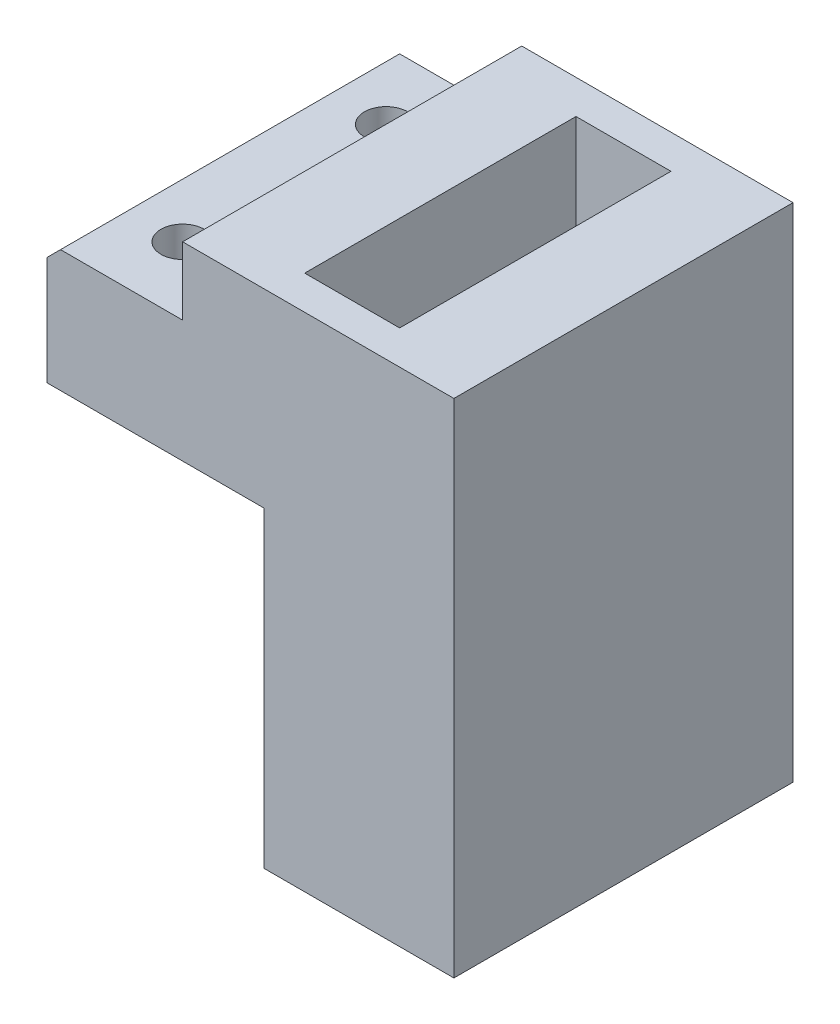
ISO-10303-21;
HEADER;
FILE_DESCRIPTION(('STEP AP214'),'2;1');
FILE_NAME('part.step','',(''),(''),'','','');
FILE_SCHEMA(('AUTOMOTIVE_DESIGN { 1 0 10303 214 1 1 1 1 }'));
ENDSEC;
DATA;
#1=APPLICATION_CONTEXT('core data for automotive mechanical design processes');
#2=APPLICATION_PROTOCOL_DEFINITION('international standard','automotive_design',2000,#1);
#3=PRODUCT_CONTEXT('',#1,'mechanical');
#4=PRODUCT('Part','Part','',(#3));
#5=PRODUCT_RELATED_PRODUCT_CATEGORY('part','',(#4));
#6=PRODUCT_DEFINITION_FORMATION('','',#4);
#7=PRODUCT_DEFINITION_CONTEXT('part definition',#1,'design');
#8=PRODUCT_DEFINITION('design','',#6,#7);
#9=PRODUCT_DEFINITION_SHAPE('','',#8);
#10=(LENGTH_UNIT() NAMED_UNIT(*) SI_UNIT(.MILLI.,.METRE.));
#11=(NAMED_UNIT(*) PLANE_ANGLE_UNIT() SI_UNIT($,.RADIAN.));
#12=(NAMED_UNIT(*) SI_UNIT($,.STERADIAN.) SOLID_ANGLE_UNIT());
#13=UNCERTAINTY_MEASURE_WITH_UNIT(LENGTH_MEASURE(1.E-05),#10,'distance_accuracy_value','');
#14=(GEOMETRIC_REPRESENTATION_CONTEXT(3) GLOBAL_UNCERTAINTY_ASSIGNED_CONTEXT((#13)) GLOBAL_UNIT_ASSIGNED_CONTEXT((#10,
#11,#12)) REPRESENTATION_CONTEXT('',''));
#15=CARTESIAN_POINT('',(0.,0.,0.));
#16=DIRECTION('',(0.,0.,1.));
#17=DIRECTION('',(1.,0.,0.));
#18=AXIS2_PLACEMENT_3D('',#15,#16,#17);
#19=CARTESIAN_POINT('',(0.,14.,12.5));
#20=DIRECTION('',(1.,0.,0.));
#21=DIRECTION('',(0.,0.,-1.));
#22=AXIS2_PLACEMENT_3D('',#19,#20,#21);
#23=PLANE('',#22);
#24=DIRECTION('',(0.,-1.,0.));
#25=VECTOR('',#24,1.);
#26=CARTESIAN_POINT('',(0.,14.,12.5));
#27=LINE('',#26,#25);
#28=CARTESIAN_POINT('',(0.,7.99999999999999,12.5));
#29=VERTEX_POINT('',#28);
#30=CARTESIAN_POINT('',(0.,0.,12.5));
#31=VERTEX_POINT('',#30);
#32=EDGE_CURVE('E142',#29,#31,#27,.T.);
#33=ORIENTED_EDGE('',*,*,#32,.F.);
#34=DIRECTION('',(0.,0.,-1.));
#35=VECTOR('',#34,1.);
#36=CARTESIAN_POINT('',(0.,7.99999999999999,-12.5));
#37=LINE('',#36,#35);
#38=CARTESIAN_POINT('',(0.,7.99999999999999,-12.5));
#39=VERTEX_POINT('',#38);
#40=EDGE_CURVE('E44',#29,#39,#37,.T.);
#41=ORIENTED_EDGE('',*,*,#40,.T.);
#42=DIRECTION('',(0.,-1.,0.));
#43=VECTOR('',#42,1.);
#44=CARTESIAN_POINT('',(0.,14.,-12.5));
#45=LINE('',#44,#43);
#46=CARTESIAN_POINT('',(0.,0.,-12.5));
#47=VERTEX_POINT('',#46);
#48=EDGE_CURVE('E240',#39,#47,#45,.T.);
#49=ORIENTED_EDGE('',*,*,#48,.T.);
#50=DIRECTION('',(0.,0.,1.));
#51=VECTOR('',#50,1.);
#52=CARTESIAN_POINT('',(0.,0.,12.5));
#53=LINE('',#52,#51);
#54=EDGE_CURVE('E234',#47,#31,#53,.T.);
#55=ORIENTED_EDGE('',*,*,#54,.T.);
#56=EDGE_LOOP('',(#33,#41,#49,#55));
#57=FACE_BOUND('',#56,.T.);
#58=ADVANCED_FACE('F35',(#57),#23,.F.);
#59=CARTESIAN_POINT('',(5.,14.,7.5));
#60=DIRECTION('',(0.,1.,0.));
#61=DIRECTION('',(0.,0.,1.));
#62=AXIS2_PLACEMENT_3D('',#59,#60,#61);
#63=CYLINDRICAL_SURFACE('',#62,1.59999999999999);
#64=CARTESIAN_POINT('',(5.,0.,7.5));
#65=DIRECTION('',(0.,1.,0.));
#66=DIRECTION('',(0.,0.,1.));
#67=AXIS2_PLACEMENT_3D('',#64,#65,#66);
#68=CIRCLE('',#67,1.6);
#69=CARTESIAN_POINT('',(5.,0.,9.1));
#70=VERTEX_POINT('',#69);
#71=EDGE_CURVE('E222',#70,#70,#68,.T.);
#72=ORIENTED_EDGE('',*,*,#71,.F.);
#73=EDGE_LOOP('',(#72));
#74=FACE_BOUND('',#73,.T.);
#75=CARTESIAN_POINT('',(5.,9.,7.5));
#76=DIRECTION('',(0.,1.,0.));
#77=DIRECTION('',(0.,0.,1.));
#78=AXIS2_PLACEMENT_3D('',#75,#76,#77);
#79=CIRCLE('',#78,1.59999999999999);
#80=CARTESIAN_POINT('',(5.,9.,9.09999999999999));
#81=VERTEX_POINT('',#80);
#82=EDGE_CURVE('E184',#81,#81,#79,.F.);
#83=ORIENTED_EDGE('',*,*,#82,.F.);
#84=EDGE_LOOP('',(#83));
#85=FACE_BOUND('',#84,.T.);
#86=ADVANCED_FACE('F278',(#74,#85),#63,.F.);
#87=CARTESIAN_POINT('',(5.,14.,-7.5));
#88=DIRECTION('',(0.,1.,0.));
#89=DIRECTION('',(0.,0.,1.));
#90=AXIS2_PLACEMENT_3D('',#87,#88,#89);
#91=CYLINDRICAL_SURFACE('',#90,1.59999999999999);
#92=CARTESIAN_POINT('',(5.,0.,-7.5));
#93=DIRECTION('',(0.,1.,0.));
#94=DIRECTION('',(0.,0.,1.));
#95=AXIS2_PLACEMENT_3D('',#92,#93,#94);
#96=CIRCLE('',#95,1.6);
#97=CARTESIAN_POINT('',(5.,0.,-5.9));
#98=VERTEX_POINT('',#97);
#99=EDGE_CURVE('E213',#98,#98,#96,.T.);
#100=ORIENTED_EDGE('',*,*,#99,.F.);
#101=EDGE_LOOP('',(#100));
#102=FACE_BOUND('',#101,.T.);
#103=CARTESIAN_POINT('',(5.,9.,-7.5));
#104=DIRECTION('',(0.,1.,0.));
#105=DIRECTION('',(0.,0.,1.));
#106=AXIS2_PLACEMENT_3D('',#103,#104,#105);
#107=CIRCLE('',#106,1.59999999999999);
#108=CARTESIAN_POINT('',(5.,9.,-5.90000000000001));
#109=VERTEX_POINT('',#108);
#110=EDGE_CURVE('E182',#109,#109,#107,.F.);
#111=ORIENTED_EDGE('',*,*,#110,.F.);
#112=EDGE_LOOP('',(#111));
#113=FACE_BOUND('',#112,.T.);
#114=ADVANCED_FACE('F283',(#102,#113),#91,.F.);
#115=CARTESIAN_POINT('',(0.,14.,-12.5));
#116=DIRECTION('',(0.,0.,1.));
#117=DIRECTION('',(1.,0.,0.));
#118=AXIS2_PLACEMENT_3D('',#115,#116,#117);
#119=PLANE('',#118);
#120=ORIENTED_EDGE('',*,*,#48,.F.);
#121=DIRECTION('',(0.707106781186546,0.707106781186549,0.));
#122=VECTOR('',#121,1.);
#123=CARTESIAN_POINT('',(1.,9.,-12.5));
#124=LINE('',#123,#122);
#125=CARTESIAN_POINT('',(1.,9.,-12.5));
#126=VERTEX_POINT('',#125);
#127=EDGE_CURVE('E11',#39,#126,#124,.T.);
#128=ORIENTED_EDGE('',*,*,#127,.T.);
#129=DIRECTION('',(-1.,0.,0.));
#130=VECTOR('',#129,1.);
#131=CARTESIAN_POINT('',(0.,9.,-12.5));
#132=LINE('',#131,#130);
#133=CARTESIAN_POINT('',(9.99999999999999,9.,-12.5));
#134=VERTEX_POINT('',#133);
#135=EDGE_CURVE('E174',#134,#126,#132,.T.);
#136=ORIENTED_EDGE('',*,*,#135,.F.);
#137=DIRECTION('',(0.,1.,0.));
#138=VECTOR('',#137,1.);
#139=CARTESIAN_POINT('',(9.99999999999999,9.,-12.5));
#140=LINE('',#139,#138);
#141=CARTESIAN_POINT('',(9.99999999999999,14.,-12.5));
#142=VERTEX_POINT('',#141);
#143=EDGE_CURVE('E179',#134,#142,#140,.T.);
#144=ORIENTED_EDGE('',*,*,#143,.T.);
#145=DIRECTION('',(-1.,0.,0.));
#146=VECTOR('',#145,1.);
#147=CARTESIAN_POINT('',(0.,14.,-12.5));
#148=LINE('',#147,#146);
#149=CARTESIAN_POINT('',(30.,14.,-12.5));
#150=VERTEX_POINT('',#149);
#151=EDGE_CURVE('E226',#150,#142,#148,.T.);
#152=ORIENTED_EDGE('',*,*,#151,.F.);
#153=DIRECTION('',(0.,-1.,0.));
#154=VECTOR('',#153,1.);
#155=CARTESIAN_POINT('',(30.,14.,-12.5));
#156=LINE('',#155,#154);
#157=CARTESIAN_POINT('',(30.,-23.,-12.5));
#158=VERTEX_POINT('',#157);
#159=EDGE_CURVE('E143',#150,#158,#156,.T.);
#160=ORIENTED_EDGE('',*,*,#159,.T.);
#161=DIRECTION('',(1.,0.,0.));
#162=VECTOR('',#161,1.);
#163=CARTESIAN_POINT('',(30.,-23.,-12.5));
#164=LINE('',#163,#162);
#165=CARTESIAN_POINT('',(16.,-23.,-12.5));
#166=VERTEX_POINT('',#165);
#167=EDGE_CURVE('E158',#166,#158,#164,.T.);
#168=ORIENTED_EDGE('',*,*,#167,.F.);
#169=DIRECTION('',(0.,1.,0.));
#170=VECTOR('',#169,1.);
#171=CARTESIAN_POINT('',(16.,-23.,-12.5));
#172=LINE('',#171,#170);
#173=CARTESIAN_POINT('',(16.,0.,-12.5));
#174=VERTEX_POINT('',#173);
#175=EDGE_CURVE('E163',#166,#174,#172,.T.);
#176=ORIENTED_EDGE('',*,*,#175,.T.);
#177=DIRECTION('',(-1.,0.,0.));
#178=VECTOR('',#177,1.);
#179=CARTESIAN_POINT('',(0.,0.,-12.5));
#180=LINE('',#179,#178);
#181=EDGE_CURVE('E225',#174,#47,#180,.T.);
#182=ORIENTED_EDGE('',*,*,#181,.T.);
#183=EDGE_LOOP('',(#120,#128,#136,#144,#152,#160,#168,#176,#182));
#184=FACE_BOUND('',#183,.T.);
#185=ADVANCED_FACE('F255',(#184),#119,.F.);
#186=CARTESIAN_POINT('',(30.,14.,12.5));
#187=DIRECTION('',(0.,0.,-1.));
#188=DIRECTION('',(-1.,0.,0.));
#189=AXIS2_PLACEMENT_3D('',#186,#187,#188);
#190=PLANE('',#189);
#191=DIRECTION('',(1.,0.,0.));
#192=VECTOR('',#191,1.);
#193=CARTESIAN_POINT('',(0.,9.,12.5));
#194=LINE('',#193,#192);
#195=CARTESIAN_POINT('',(1.,9.,12.5));
#196=VERTEX_POINT('',#195);
#197=CARTESIAN_POINT('',(10.,9.,12.5));
#198=VERTEX_POINT('',#197);
#199=EDGE_CURVE('E169',#196,#198,#194,.T.);
#200=ORIENTED_EDGE('',*,*,#199,.F.);
#201=DIRECTION('',(-0.707106781186546,-0.707106781186549,0.));
#202=VECTOR('',#201,1.);
#203=CARTESIAN_POINT('',(1.00000000000001,9.,12.5));
#204=LINE('',#203,#202);
#205=EDGE_CURVE('E247',#196,#29,#204,.T.);
#206=ORIENTED_EDGE('',*,*,#205,.T.);
#207=ORIENTED_EDGE('',*,*,#32,.T.);
#208=DIRECTION('',(1.,0.,0.));
#209=VECTOR('',#208,1.);
#210=CARTESIAN_POINT('',(30.,0.,12.5));
#211=LINE('',#210,#209);
#212=CARTESIAN_POINT('',(16.,0.,12.5));
#213=VERTEX_POINT('',#212);
#214=EDGE_CURVE('E230',#31,#213,#211,.T.);
#215=ORIENTED_EDGE('',*,*,#214,.T.);
#216=DIRECTION('',(0.,1.,0.));
#217=VECTOR('',#216,1.);
#218=CARTESIAN_POINT('',(16.,-23.,12.5));
#219=LINE('',#218,#217);
#220=CARTESIAN_POINT('',(16.,-23.,12.5));
#221=VERTEX_POINT('',#220);
#222=EDGE_CURVE('E150',#221,#213,#219,.T.);
#223=ORIENTED_EDGE('',*,*,#222,.F.);
#224=DIRECTION('',(-1.,0.,0.));
#225=VECTOR('',#224,1.);
#226=CARTESIAN_POINT('',(30.,-23.,12.5));
#227=LINE('',#226,#225);
#228=CARTESIAN_POINT('',(30.,-23.,12.5));
#229=VERTEX_POINT('',#228);
#230=EDGE_CURVE('E146',#229,#221,#227,.T.);
#231=ORIENTED_EDGE('',*,*,#230,.F.);
#232=DIRECTION('',(0.,-1.,0.));
#233=VECTOR('',#232,1.);
#234=CARTESIAN_POINT('',(30.,14.,12.5));
#235=LINE('',#234,#233);
#236=CARTESIAN_POINT('',(30.,14.,12.5));
#237=VERTEX_POINT('',#236);
#238=EDGE_CURVE('E133',#237,#229,#235,.T.);
#239=ORIENTED_EDGE('',*,*,#238,.F.);
#240=DIRECTION('',(1.,0.,0.));
#241=VECTOR('',#240,1.);
#242=CARTESIAN_POINT('',(30.,14.,12.5));
#243=LINE('',#242,#241);
#244=CARTESIAN_POINT('',(10.,14.,12.5));
#245=VERTEX_POINT('',#244);
#246=EDGE_CURVE('E229',#245,#237,#243,.T.);
#247=ORIENTED_EDGE('',*,*,#246,.F.);
#248=DIRECTION('',(0.,1.,0.));
#249=VECTOR('',#248,1.);
#250=CARTESIAN_POINT('',(10.,9.,12.5));
#251=LINE('',#250,#249);
#252=EDGE_CURVE('E177',#198,#245,#251,.T.);
#253=ORIENTED_EDGE('',*,*,#252,.F.);
#254=EDGE_LOOP('',(#200,#206,#207,#215,#223,#231,#239,#247,#253));
#255=FACE_BOUND('',#254,.T.);
#256=ADVANCED_FACE('F148',(#255),#190,.F.);
#257=CARTESIAN_POINT('',(30.,14.,-12.5));
#258=DIRECTION('',(-1.,0.,0.));
#259=DIRECTION('',(0.,0.,1.));
#260=AXIS2_PLACEMENT_3D('',#257,#258,#259);
#261=PLANE('',#260);
#262=ORIENTED_EDGE('',*,*,#238,.T.);
#263=DIRECTION('',(0.,0.,1.));
#264=VECTOR('',#263,1.);
#265=CARTESIAN_POINT('',(30.,-23.,-12.5));
#266=LINE('',#265,#264);
#267=EDGE_CURVE('E138',#158,#229,#266,.T.);
#268=ORIENTED_EDGE('',*,*,#267,.F.);
#269=ORIENTED_EDGE('',*,*,#159,.F.);
#270=DIRECTION('',(0.,0.,-1.));
#271=VECTOR('',#270,1.);
#272=CARTESIAN_POINT('',(30.,14.,-12.5));
#273=LINE('',#272,#271);
#274=EDGE_CURVE('E139',#237,#150,#273,.T.);
#275=ORIENTED_EDGE('',*,*,#274,.F.);
#276=EDGE_LOOP('',(#262,#268,#269,#275));
#277=FACE_BOUND('',#276,.T.);
#278=ADVANCED_FACE('F135',(#277),#261,.F.);
#279=CARTESIAN_POINT('',(0.,14.,0.));
#280=DIRECTION('',(0.,-1.,0.));
#281=DIRECTION('',(0.,0.,-1.));
#282=AXIS2_PLACEMENT_3D('',#279,#280,#281);
#283=PLANE('',#282);
#284=DIRECTION('',(1.,0.,0.));
#285=VECTOR('',#284,1.);
#286=CARTESIAN_POINT('',(23.5,14.,9.99999999999999));
#287=LINE('',#286,#285);
#288=CARTESIAN_POINT('',(16.5,14.,10.));
#289=VERTEX_POINT('',#288);
#290=CARTESIAN_POINT('',(23.5,14.,9.99999999999999));
#291=VERTEX_POINT('',#290);
#292=EDGE_CURVE('E203',#289,#291,#287,.T.);
#293=ORIENTED_EDGE('',*,*,#292,.F.);
#294=DIRECTION('',(0.,0.,1.));
#295=VECTOR('',#294,1.);
#296=CARTESIAN_POINT('',(16.5,14.,10.));
#297=LINE('',#296,#295);
#298=CARTESIAN_POINT('',(16.5,14.,-10.));
#299=VERTEX_POINT('',#298);
#300=EDGE_CURVE('E187',#299,#289,#297,.T.);
#301=ORIENTED_EDGE('',*,*,#300,.F.);
#302=DIRECTION('',(-1.,0.,0.));
#303=VECTOR('',#302,1.);
#304=CARTESIAN_POINT('',(23.5,14.,-10.));
#305=LINE('',#304,#303);
#306=CARTESIAN_POINT('',(23.5,14.,-10.));
#307=VERTEX_POINT('',#306);
#308=EDGE_CURVE('E192',#307,#299,#305,.T.);
#309=ORIENTED_EDGE('',*,*,#308,.F.);
#310=DIRECTION('',(0.,0.,-1.));
#311=VECTOR('',#310,1.);
#312=CARTESIAN_POINT('',(23.5,14.,9.99999999999999));
#313=LINE('',#312,#311);
#314=EDGE_CURVE('E206',#291,#307,#313,.T.);
#315=ORIENTED_EDGE('',*,*,#314,.F.);
#316=EDGE_LOOP('',(#293,#301,#309,#315));
#317=FACE_BOUND('',#316,.T.);
#318=ORIENTED_EDGE('',*,*,#151,.T.);
#319=DIRECTION('',(0.,0.,-1.));
#320=VECTOR('',#319,1.);
#321=CARTESIAN_POINT('',(9.99999999999999,14.,-12.5));
#322=LINE('',#321,#320);
#323=EDGE_CURVE('E168',#245,#142,#322,.T.);
#324=ORIENTED_EDGE('',*,*,#323,.F.);
#325=ORIENTED_EDGE('',*,*,#246,.T.);
#326=ORIENTED_EDGE('',*,*,#274,.T.);
#327=EDGE_LOOP('',(#318,#324,#325,#326));
#328=FACE_BOUND('',#327,.T.);
#329=ADVANCED_FACE('F264',(#317,#328),#283,.F.);
#330=CARTESIAN_POINT('',(0.,0.,0.));
#331=DIRECTION('',(0.,-1.,0.));
#332=DIRECTION('',(0.,0.,-1.));
#333=AXIS2_PLACEMENT_3D('',#330,#331,#332);
#334=PLANE('',#333);
#335=DIRECTION('',(0.,0.,-1.));
#336=VECTOR('',#335,1.);
#337=CARTESIAN_POINT('',(16.,0.,-12.5));
#338=LINE('',#337,#336);
#339=EDGE_CURVE('E51',#213,#174,#338,.T.);
#340=ORIENTED_EDGE('',*,*,#339,.F.);
#341=ORIENTED_EDGE('',*,*,#214,.F.);
#342=ORIENTED_EDGE('',*,*,#54,.F.);
#343=ORIENTED_EDGE('',*,*,#181,.F.);
#344=EDGE_LOOP('',(#340,#341,#342,#343));
#345=FACE_BOUND('',#344,.T.);
#346=ORIENTED_EDGE('',*,*,#99,.T.);
#347=EDGE_LOOP('',(#346));
#348=FACE_BOUND('',#347,.T.);
#349=ORIENTED_EDGE('',*,*,#71,.T.);
#350=EDGE_LOOP('',(#349));
#351=FACE_BOUND('',#350,.T.);
#352=ADVANCED_FACE('F305',(#345,#348,#351),#334,.T.);
#353=CARTESIAN_POINT('',(16.5,4.,10.));
#354=DIRECTION('',(-1.,0.,0.));
#355=DIRECTION('',(0.,0.,1.));
#356=AXIS2_PLACEMENT_3D('',#353,#354,#355);
#357=PLANE('',#356);
#358=ORIENTED_EDGE('',*,*,#300,.T.);
#359=DIRECTION('',(0.,1.,0.));
#360=VECTOR('',#359,1.);
#361=CARTESIAN_POINT('',(16.5,4.,10.));
#362=LINE('',#361,#360);
#363=CARTESIAN_POINT('',(16.5,4.,10.));
#364=VERTEX_POINT('',#363);
#365=EDGE_CURVE('E201',#364,#289,#362,.T.);
#366=ORIENTED_EDGE('',*,*,#365,.F.);
#367=DIRECTION('',(0.,0.,1.));
#368=VECTOR('',#367,1.);
#369=CARTESIAN_POINT('',(16.5,4.,10.));
#370=LINE('',#369,#368);
#371=CARTESIAN_POINT('',(16.5,4.,-10.));
#372=VERTEX_POINT('',#371);
#373=EDGE_CURVE('E188',#372,#364,#370,.T.);
#374=ORIENTED_EDGE('',*,*,#373,.F.);
#375=DIRECTION('',(0.,1.,0.));
#376=VECTOR('',#375,1.);
#377=CARTESIAN_POINT('',(16.5,4.,-10.));
#378=LINE('',#377,#376);
#379=EDGE_CURVE('E211',#372,#299,#378,.T.);
#380=ORIENTED_EDGE('',*,*,#379,.T.);
#381=EDGE_LOOP('',(#358,#366,#374,#380));
#382=FACE_BOUND('',#381,.T.);
#383=ADVANCED_FACE('F300',(#382),#357,.F.);
#384=CARTESIAN_POINT('',(23.5,4.,-10.));
#385=DIRECTION('',(0.,0.,-1.));
#386=DIRECTION('',(-1.,0.,0.));
#387=AXIS2_PLACEMENT_3D('',#384,#385,#386);
#388=PLANE('',#387);
#389=ORIENTED_EDGE('',*,*,#308,.T.);
#390=ORIENTED_EDGE('',*,*,#379,.F.);
#391=DIRECTION('',(-1.,0.,0.));
#392=VECTOR('',#391,1.);
#393=CARTESIAN_POINT('',(23.5,4.,-10.));
#394=LINE('',#393,#392);
#395=CARTESIAN_POINT('',(23.5,4.,-10.));
#396=VERTEX_POINT('',#395);
#397=EDGE_CURVE('E198',#396,#372,#394,.T.);
#398=ORIENTED_EDGE('',*,*,#397,.F.);
#399=DIRECTION('',(0.,1.,0.));
#400=VECTOR('',#399,1.);
#401=CARTESIAN_POINT('',(23.5,4.,-10.));
#402=LINE('',#401,#400);
#403=EDGE_CURVE('E214',#396,#307,#402,.T.);
#404=ORIENTED_EDGE('',*,*,#403,.T.);
#405=EDGE_LOOP('',(#389,#390,#398,#404));
#406=FACE_BOUND('',#405,.T.);
#407=ADVANCED_FACE('F328',(#406),#388,.F.);
#408=CARTESIAN_POINT('',(23.5,4.,9.99999999999999));
#409=DIRECTION('',(1.,0.,0.));
#410=DIRECTION('',(0.,0.,-1.));
#411=AXIS2_PLACEMENT_3D('',#408,#409,#410);
#412=PLANE('',#411);
#413=ORIENTED_EDGE('',*,*,#314,.T.);
#414=ORIENTED_EDGE('',*,*,#403,.F.);
#415=DIRECTION('',(0.,0.,-1.));
#416=VECTOR('',#415,1.);
#417=CARTESIAN_POINT('',(23.5,4.,9.99999999999999));
#418=LINE('',#417,#416);
#419=CARTESIAN_POINT('',(23.5,4.,9.99999999999999));
#420=VERTEX_POINT('',#419);
#421=EDGE_CURVE('E195',#420,#396,#418,.T.);
#422=ORIENTED_EDGE('',*,*,#421,.F.);
#423=DIRECTION('',(0.,1.,0.));
#424=VECTOR('',#423,1.);
#425=CARTESIAN_POINT('',(23.5,4.,9.99999999999999));
#426=LINE('',#425,#424);
#427=EDGE_CURVE('E216',#420,#291,#426,.T.);
#428=ORIENTED_EDGE('',*,*,#427,.T.);
#429=EDGE_LOOP('',(#413,#414,#422,#428));
#430=FACE_BOUND('',#429,.T.);
#431=ADVANCED_FACE('F335',(#430),#412,.F.);
#432=CARTESIAN_POINT('',(23.5,4.,9.99999999999999));
#433=DIRECTION('',(0.,0.,1.));
#434=DIRECTION('',(1.,0.,0.));
#435=AXIS2_PLACEMENT_3D('',#432,#433,#434);
#436=PLANE('',#435);
#437=ORIENTED_EDGE('',*,*,#292,.T.);
#438=ORIENTED_EDGE('',*,*,#427,.F.);
#439=DIRECTION('',(1.,0.,0.));
#440=VECTOR('',#439,1.);
#441=CARTESIAN_POINT('',(23.5,4.,9.99999999999999));
#442=LINE('',#441,#440);
#443=EDGE_CURVE('E191',#364,#420,#442,.T.);
#444=ORIENTED_EDGE('',*,*,#443,.F.);
#445=ORIENTED_EDGE('',*,*,#365,.T.);
#446=EDGE_LOOP('',(#437,#438,#444,#445));
#447=FACE_BOUND('',#446,.T.);
#448=ADVANCED_FACE('F343',(#447),#436,.F.);
#449=CARTESIAN_POINT('',(0.,4.,0.));
#450=DIRECTION('',(0.,1.,0.));
#451=DIRECTION('',(0.,0.,1.));
#452=AXIS2_PLACEMENT_3D('',#449,#450,#451);
#453=PLANE('',#452);
#454=ORIENTED_EDGE('',*,*,#373,.T.);
#455=ORIENTED_EDGE('',*,*,#443,.T.);
#456=ORIENTED_EDGE('',*,*,#421,.T.);
#457=ORIENTED_EDGE('',*,*,#397,.T.);
#458=EDGE_LOOP('',(#454,#455,#456,#457));
#459=FACE_BOUND('',#458,.T.);
#460=ADVANCED_FACE('F351',(#459),#453,.T.);
#461=CARTESIAN_POINT('',(0.,9.,0.));
#462=DIRECTION('',(0.,1.,0.));
#463=DIRECTION('',(0.,0.,1.));
#464=AXIS2_PLACEMENT_3D('',#461,#462,#463);
#465=PLANE('',#464);
#466=ORIENTED_EDGE('',*,*,#135,.T.);
#467=DIRECTION('',(0.,0.,1.));
#468=VECTOR('',#467,1.);
#469=CARTESIAN_POINT('',(1.,9.,12.5));
#470=LINE('',#469,#468);
#471=EDGE_CURVE('E242',#126,#196,#470,.T.);
#472=ORIENTED_EDGE('',*,*,#471,.T.);
#473=ORIENTED_EDGE('',*,*,#199,.T.);
#474=DIRECTION('',(0.,0.,-1.));
#475=VECTOR('',#474,1.);
#476=CARTESIAN_POINT('',(9.99999999999999,9.,-12.5));
#477=LINE('',#476,#475);
#478=EDGE_CURVE('E171',#198,#134,#477,.T.);
#479=ORIENTED_EDGE('',*,*,#478,.T.);
#480=EDGE_LOOP('',(#466,#472,#473,#479));
#481=FACE_BOUND('',#480,.T.);
#482=ORIENTED_EDGE('',*,*,#110,.T.);
#483=EDGE_LOOP('',(#482));
#484=FACE_BOUND('',#483,.T.);
#485=ORIENTED_EDGE('',*,*,#82,.T.);
#486=EDGE_LOOP('',(#485));
#487=FACE_BOUND('',#486,.T.);
#488=ADVANCED_FACE('F257',(#481,#484,#487),#465,.T.);
#489=CARTESIAN_POINT('',(9.99999999999999,9.,-12.5));
#490=DIRECTION('',(1.,0.,0.));
#491=DIRECTION('',(0.,0.,-1.));
#492=AXIS2_PLACEMENT_3D('',#489,#490,#491);
#493=PLANE('',#492);
#494=ORIENTED_EDGE('',*,*,#323,.T.);
#495=ORIENTED_EDGE('',*,*,#143,.F.);
#496=ORIENTED_EDGE('',*,*,#478,.F.);
#497=ORIENTED_EDGE('',*,*,#252,.T.);
#498=EDGE_LOOP('',(#494,#495,#496,#497));
#499=FACE_BOUND('',#498,.T.);
#500=ADVANCED_FACE('F261',(#499),#493,.F.);
#501=CARTESIAN_POINT('',(1.,9.,0.));
#502=DIRECTION('',(-0.707106781186549,0.707106781186546,0.));
#503=DIRECTION('',(0.,0.,-1.));
#504=AXIS2_PLACEMENT_3D('',#501,#502,#503);
#505=PLANE('',#504);
#506=ORIENTED_EDGE('',*,*,#127,.F.);
#507=ORIENTED_EDGE('',*,*,#40,.F.);
#508=ORIENTED_EDGE('',*,*,#205,.F.);
#509=ORIENTED_EDGE('',*,*,#471,.F.);
#510=EDGE_LOOP('',(#506,#507,#508,#509));
#511=FACE_BOUND('',#510,.T.);
#512=ADVANCED_FACE('F38',(#511),#505,.T.);
#513=CARTESIAN_POINT('',(16.,-23.,-12.5));
#514=DIRECTION('',(1.,0.,0.));
#515=DIRECTION('',(0.,0.,-1.));
#516=AXIS2_PLACEMENT_3D('',#513,#514,#515);
#517=PLANE('',#516);
#518=ORIENTED_EDGE('',*,*,#339,.T.);
#519=ORIENTED_EDGE('',*,*,#175,.F.);
#520=DIRECTION('',(0.,0.,-1.));
#521=VECTOR('',#520,1.);
#522=CARTESIAN_POINT('',(16.,-23.,-12.5));
#523=LINE('',#522,#521);
#524=EDGE_CURVE('E153',#221,#166,#523,.T.);
#525=ORIENTED_EDGE('',*,*,#524,.F.);
#526=ORIENTED_EDGE('',*,*,#222,.T.);
#527=EDGE_LOOP('',(#518,#519,#525,#526));
#528=FACE_BOUND('',#527,.T.);
#529=ADVANCED_FACE('F268',(#528),#517,.F.);
#530=CARTESIAN_POINT('',(0.,-23.,0.));
#531=DIRECTION('',(0.,-1.,0.));
#532=DIRECTION('',(0.,0.,-1.));
#533=AXIS2_PLACEMENT_3D('',#530,#531,#532);
#534=PLANE('',#533);
#535=ORIENTED_EDGE('',*,*,#267,.T.);
#536=ORIENTED_EDGE('',*,*,#230,.T.);
#537=ORIENTED_EDGE('',*,*,#524,.T.);
#538=ORIENTED_EDGE('',*,*,#167,.T.);
#539=EDGE_LOOP('',(#535,#536,#537,#538));
#540=FACE_BOUND('',#539,.T.);
#541=ADVANCED_FACE('F156',(#540),#534,.T.);
#542=CLOSED_SHELL('',(#58,#86,#114,#185,#256,#278,#329,#352,#383,#407,#431,#448,#460,#488,#500,
#512,#529,#541));
#543=MANIFOLD_SOLID_BREP('B2',#542);
#544=ADVANCED_BREP_SHAPE_REPRESENTATION('',(#18,#543),#14);
#545=SHAPE_DEFINITION_REPRESENTATION(#9,#544);
ENDSEC;
END-ISO-10303-21;
